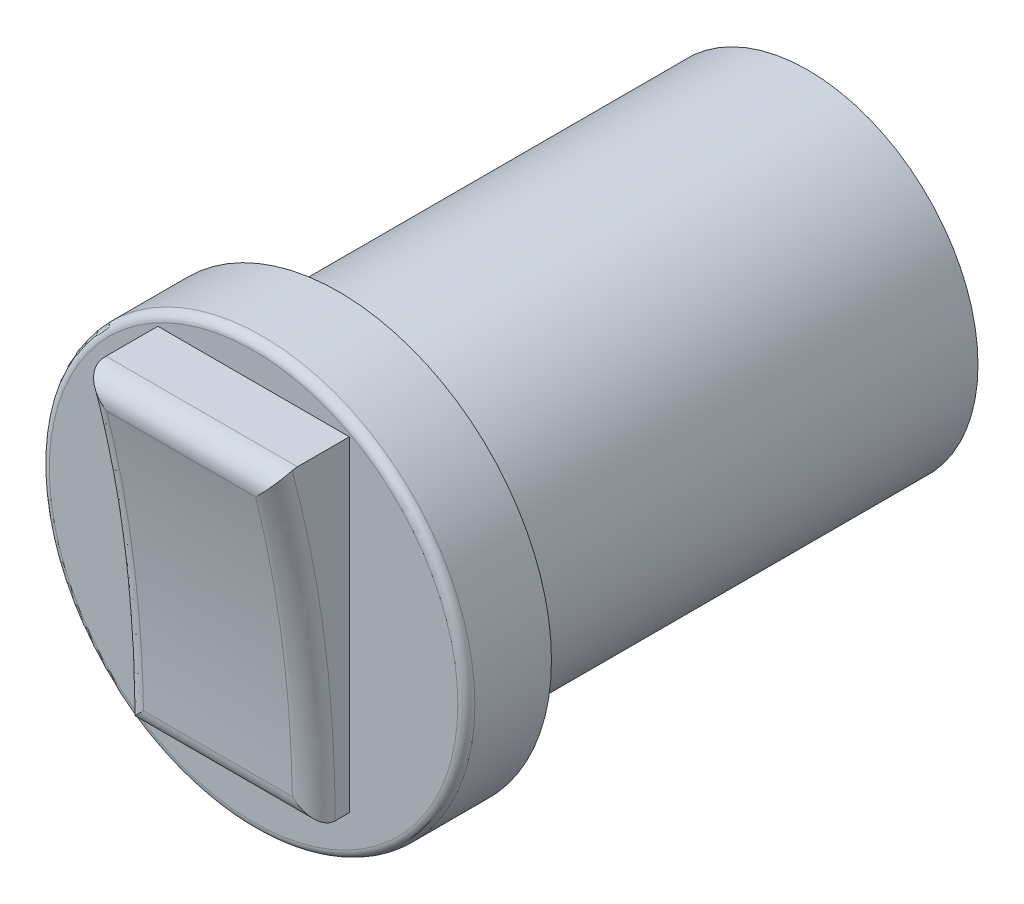
ISO-10303-21;
HEADER;
FILE_DESCRIPTION(('STEP AP214'),'2;1');
FILE_NAME('part.step','',(''),(''),'','','');
FILE_SCHEMA(('AUTOMOTIVE_DESIGN { 1 0 10303 214 1 1 1 1 }'));
ENDSEC;
DATA;
#1=APPLICATION_CONTEXT('core data for automotive mechanical design processes');
#2=APPLICATION_PROTOCOL_DEFINITION('international standard','automotive_design',2000,#1);
#3=PRODUCT_CONTEXT('',#1,'mechanical');
#4=PRODUCT('Part','Part','',(#3));
#5=PRODUCT_RELATED_PRODUCT_CATEGORY('part','',(#4));
#6=PRODUCT_DEFINITION_FORMATION('','',#4);
#7=PRODUCT_DEFINITION_CONTEXT('part definition',#1,'design');
#8=PRODUCT_DEFINITION('design','',#6,#7);
#9=PRODUCT_DEFINITION_SHAPE('','',#8);
#10=(LENGTH_UNIT() NAMED_UNIT(*) SI_UNIT(.MILLI.,.METRE.));
#11=(NAMED_UNIT(*) PLANE_ANGLE_UNIT() SI_UNIT($,.RADIAN.));
#12=(NAMED_UNIT(*) SI_UNIT($,.STERADIAN.) SOLID_ANGLE_UNIT());
#13=UNCERTAINTY_MEASURE_WITH_UNIT(LENGTH_MEASURE(1.E-05),#10,'distance_accuracy_value','');
#14=(GEOMETRIC_REPRESENTATION_CONTEXT(3) GLOBAL_UNCERTAINTY_ASSIGNED_CONTEXT((#13)) GLOBAL_UNIT_ASSIGNED_CONTEXT((#10,
#11,#12)) REPRESENTATION_CONTEXT('',''));
#15=CARTESIAN_POINT('',(0.,0.,0.));
#16=DIRECTION('',(0.,0.,1.));
#17=DIRECTION('',(1.,0.,0.));
#18=AXIS2_PLACEMENT_3D('',#15,#16,#17);
#19=CARTESIAN_POINT('',(0.,0.,33.08));
#20=DIRECTION('',(0.,0.,1.));
#21=DIRECTION('',(1.,0.,0.));
#22=AXIS2_PLACEMENT_3D('',#19,#20,#21);
#23=PLANE('',#22);
#24=CARTESIAN_POINT('',(0.,0.,33.08));
#25=DIRECTION('',(0.,0.,1.));
#26=DIRECTION('',(1.,0.,0.));
#27=AXIS2_PLACEMENT_3D('',#24,#25,#26);
#28=CIRCLE('',#27,12.192);
#29=CARTESIAN_POINT('',(12.192,0.,33.08));
#30=VERTEX_POINT('',#29);
#31=EDGE_CURVE('E41',#30,#30,#28,.T.);
#32=ORIENTED_EDGE('',*,*,#31,.T.);
#33=EDGE_LOOP('',(#32));
#34=FACE_BOUND('',#33,.T.);
#35=DIRECTION('',(-1.,0.,0.));
#36=VECTOR('',#35,1.);
#37=CARTESIAN_POINT('',(5.715,-8.83372150644757,33.08));
#38=LINE('',#37,#36);
#39=CARTESIAN_POINT('',(5.715,-8.83372150644757,33.08));
#40=VERTEX_POINT('',#39);
#41=CARTESIAN_POINT('',(-5.715,-8.83372150644757,33.08));
#42=VERTEX_POINT('',#41);
#43=EDGE_CURVE('E107',#40,#42,#38,.T.);
#44=ORIENTED_EDGE('',*,*,#43,.T.);
#45=DIRECTION('',(0.,1.,0.));
#46=VECTOR('',#45,1.);
#47=CARTESIAN_POINT('',(-5.715,-8.83372150644757,33.08));
#48=LINE('',#47,#46);
#49=CARTESIAN_POINT('',(-5.715,10.5940645602686,33.08));
#50=VERTEX_POINT('',#49);
#51=EDGE_CURVE('E250',#42,#50,#48,.T.);
#52=ORIENTED_EDGE('',*,*,#51,.T.);
#53=DIRECTION('',(-1.,0.,0.));
#54=VECTOR('',#53,1.);
#55=CARTESIAN_POINT('',(5.715,10.5940645602686,33.08));
#56=LINE('',#55,#54);
#57=CARTESIAN_POINT('',(5.715,10.5940645602686,33.08));
#58=VERTEX_POINT('',#57);
#59=EDGE_CURVE('E115',#58,#50,#56,.T.);
#60=ORIENTED_EDGE('',*,*,#59,.F.);
#61=DIRECTION('',(0.,1.,0.));
#62=VECTOR('',#61,1.);
#63=CARTESIAN_POINT('',(5.715,-8.83372150644757,33.08));
#64=LINE('',#63,#62);
#65=EDGE_CURVE('E100',#40,#58,#64,.T.);
#66=ORIENTED_EDGE('',*,*,#65,.F.);
#67=EDGE_LOOP('',(#44,#52,#60,#66));
#68=FACE_BOUND('',#67,.T.);
#69=ADVANCED_FACE('F33',(#34,#68),#23,.T.);
#70=CARTESIAN_POINT('',(0.,0.,28.));
#71=DIRECTION('',(0.,0.,-1.));
#72=DIRECTION('',(-1.,0.,0.));
#73=AXIS2_PLACEMENT_3D('',#70,#71,#72);
#74=CYLINDRICAL_SURFACE('',#73,10.16);
#75=CARTESIAN_POINT('',(0.,0.,28.));
#76=DIRECTION('',(0.,0.,1.));
#77=DIRECTION('',(1.,0.,0.));
#78=AXIS2_PLACEMENT_3D('',#75,#76,#77);
#79=CIRCLE('',#78,10.16);
#80=CARTESIAN_POINT('',(10.16,0.,28.));
#81=VERTEX_POINT('',#80);
#82=EDGE_CURVE('E172',#81,#81,#79,.T.);
#83=ORIENTED_EDGE('',*,*,#82,.F.);
#84=EDGE_LOOP('',(#83));
#85=FACE_BOUND('',#84,.T.);
#86=CARTESIAN_POINT('',(0.,0.,0.));
#87=DIRECTION('',(0.,0.,1.));
#88=DIRECTION('',(1.,0.,0.));
#89=AXIS2_PLACEMENT_3D('',#86,#87,#88);
#90=CIRCLE('',#89,10.16);
#91=CARTESIAN_POINT('',(10.16,0.,0.));
#92=VERTEX_POINT('',#91);
#93=EDGE_CURVE('E173',#92,#92,#90,.T.);
#94=ORIENTED_EDGE('',*,*,#93,.T.);
#95=EDGE_LOOP('',(#94));
#96=FACE_BOUND('',#95,.T.);
#97=ADVANCED_FACE('F178',(#85,#96),#74,.T.);
#98=CARTESIAN_POINT('',(0.,0.,0.));
#99=DIRECTION('',(0.,0.,1.));
#100=DIRECTION('',(1.,0.,0.));
#101=AXIS2_PLACEMENT_3D('',#98,#99,#100);
#102=PLANE('',#101);
#103=ORIENTED_EDGE('',*,*,#93,.F.);
#104=EDGE_LOOP('',(#103));
#105=FACE_BOUND('',#104,.T.);
#106=ADVANCED_FACE('F223',(#105),#102,.F.);
#107=CARTESIAN_POINT('',(0.,0.,33.08));
#108=DIRECTION('',(0.,0.,-1.));
#109=DIRECTION('',(-1.,0.,0.));
#110=AXIS2_PLACEMENT_3D('',#107,#108,#109);
#111=CYLINDRICAL_SURFACE('',#110,12.7);
#112=CARTESIAN_POINT('',(0.,0.,32.572));
#113=DIRECTION('',(0.,0.,1.));
#114=DIRECTION('',(1.,0.,0.));
#115=AXIS2_PLACEMENT_3D('',#112,#113,#114);
#116=CIRCLE('',#115,12.7);
#117=CARTESIAN_POINT('',(12.7,0.,32.572));
#118=VERTEX_POINT('',#117);
#119=EDGE_CURVE('E11',#118,#118,#116,.F.);
#120=ORIENTED_EDGE('',*,*,#119,.T.);
#121=EDGE_LOOP('',(#120));
#122=FACE_BOUND('',#121,.T.);
#123=CARTESIAN_POINT('',(0.,0.,28.));
#124=DIRECTION('',(0.,0.,1.));
#125=DIRECTION('',(1.,0.,0.));
#126=AXIS2_PLACEMENT_3D('',#123,#124,#125);
#127=CIRCLE('',#126,12.7);
#128=CARTESIAN_POINT('',(12.7,0.,28.));
#129=VERTEX_POINT('',#128);
#130=EDGE_CURVE('E114',#129,#129,#127,.T.);
#131=ORIENTED_EDGE('',*,*,#130,.T.);
#132=EDGE_LOOP('',(#131));
#133=FACE_BOUND('',#132,.T.);
#134=ADVANCED_FACE('F231',(#122,#133),#111,.T.);
#135=CARTESIAN_POINT('',(0.,0.,28.));
#136=DIRECTION('',(0.,0.,1.));
#137=DIRECTION('',(1.,0.,0.));
#138=AXIS2_PLACEMENT_3D('',#135,#136,#137);
#139=PLANE('',#138);
#140=ORIENTED_EDGE('',*,*,#82,.T.);
#141=EDGE_LOOP('',(#140));
#142=FACE_BOUND('',#141,.T.);
#143=ORIENTED_EDGE('',*,*,#130,.F.);
#144=EDGE_LOOP('',(#143));
#145=FACE_BOUND('',#144,.T.);
#146=ADVANCED_FACE('F228',(#142,#145),#139,.F.);
#147=CARTESIAN_POINT('',(5.715,-8.83372150644757,35.1996363705034));
#148=DIRECTION('',(0.,1.,0.));
#149=DIRECTION('',(0.,0.,1.));
#150=AXIS2_PLACEMENT_3D('',#147,#148,#149);
#151=PLANE('',#150);
#152=DIRECTION('',(0.,0.,-1.));
#153=VECTOR('',#152,1.);
#154=CARTESIAN_POINT('',(5.715,-8.83372150644757,35.1996363705034));
#155=LINE('',#154,#153);
#156=CARTESIAN_POINT('',(5.715,-8.83372150644757,33.9296363644892));
#157=VERTEX_POINT('',#156);
#158=EDGE_CURVE('E95',#157,#40,#155,.T.);
#159=ORIENTED_EDGE('',*,*,#158,.F.);
#160=CARTESIAN_POINT('',(5.715,-13.965042147608,33.9301399690433));
#161=CARTESIAN_POINT('',(5.715,-13.9649175056386,35.2001399629269));
#162=CARTESIAN_POINT('',(4.445,-13.9649175056386,35.2001399629269));
#163=CARTESIAN_POINT('',(5.715,-12.254643525228,33.9299721049536));
#164=CARTESIAN_POINT('',(5.715,-12.2545188832586,35.1999720988372));
#165=CARTESIAN_POINT('',(4.445,-12.2545188832586,35.19997209879));
#166=CARTESIAN_POINT('',(5.715,-10.544244902848,33.929804240864));
#167=CARTESIAN_POINT('',(5.715,-10.5441202608786,35.1998042347476));
#168=CARTESIAN_POINT('',(4.445,-10.5441202608786,35.1998042346532));
#169=CARTESIAN_POINT('',(5.715,-8.83384628046798,33.9296363767744));
#170=CARTESIAN_POINT('',(5.715,-8.83372163849857,35.199636370658));
#171=CARTESIAN_POINT('',(4.445,-8.83372163849858,35.1996363705163));
#172=CARTESIAN_POINT('',(5.715,-8.42963563821013,33.9295976491301));
#173=CARTESIAN_POINT('',(5.715,-8.43626265218967,35.1995982833622));
#174=CARTESIAN_POINT('',(4.445,-8.43626265218958,35.1995982833089));
#175=CARTESIAN_POINT('',(5.715,-8.0254413482804,33.9327811983764));
#176=CARTESIAN_POINT('',(5.715,-8.03884338245092,35.2027286445675));
#177=CARTESIAN_POINT('',(4.445,-8.03884338245087,35.2027286445527));
#178=CARTESIAN_POINT('',(5.715,-7.21706929587753,33.9456374825781));
#179=CARTESIAN_POINT('',(5.715,-7.24406357570781,35.2153687833632));
#180=CARTESIAN_POINT('',(4.445,-7.24406357570785,35.215368783378));
#181=CARTESIAN_POINT('',(5.715,-6.81289155558649,33.9553116106791));
#182=CARTESIAN_POINT('',(5.715,-6.84670306963512,35.2248799305331));
#183=CARTESIAN_POINT('',(4.445,-6.84670306963521,35.2248799305392));
#184=CARTESIAN_POINT('',(5.715,-5.14527972829637,34.0087171179528));
#185=CARTESIAN_POINT('',(5.715,-5.20729653609095,35.277381981281));
#186=CARTESIAN_POINT('',(4.445,-5.20729653609067,35.277381981262));
#187=CARTESIAN_POINT('',(5.715,-3.88260918612009,34.0811225077073));
#188=CARTESIAN_POINT('',(5.715,-3.96616667572511,35.3485558907923));
#189=CARTESIAN_POINT('',(4.445,-3.96616667572323,35.3485558907806));
#190=CARTESIAN_POINT('',(5.715,-1.36271675769742,34.2904767846415));
#191=CARTESIAN_POINT('',(5.715,-1.48947315865634,35.5543213530028));
#192=CARTESIAN_POINT('',(4.445,-1.48947315865822,35.5543213530145));
#193=CARTESIAN_POINT('',(5.715,-0.105495100454355,34.4274283584962));
#194=CARTESIAN_POINT('',(5.715,-0.253909735812633,35.6889155455123));
#195=CARTESIAN_POINT('',(4.445,-0.253909735819868,35.6889155455399));
#196=CARTESIAN_POINT('',(5.715,2.81401100549183,34.8218592193152));
#197=CARTESIAN_POINT('',(5.715,2.6152536749403,36.0765442086322));
#198=CARTESIAN_POINT('',(4.445,2.61525367494993,36.0765442085954));
#199=CARTESIAN_POINT('',(5.715,4.47304419799336,35.1041993729821));
#200=CARTESIAN_POINT('',(5.715,4.2456425140227,36.3540073980327));
#201=CARTESIAN_POINT('',(4.445,4.24564251406421,36.3540073978818));
#202=CARTESIAN_POINT('',(5.715,6.92825075345207,35.6087990884644));
#203=CARTESIAN_POINT('',(5.715,6.65869438975662,36.8499441001382));
#204=CARTESIAN_POINT('',(4.445,6.65869438973625,36.8499441002123));
#205=CARTESIAN_POINT('',(5.715,7.73345584996541,35.7883971730167));
#206=CARTESIAN_POINT('',(5.715,7.4501129201041,37.026465982265));
#207=CARTESIAN_POINT('',(4.445,7.4501129200457,37.0264659824769));
#208=CARTESIAN_POINT('',(5.715,9.33753257975253,36.1742440101229));
#209=CARTESIAN_POINT('',(5.715,9.02684358289949,37.4057350948788));
#210=CARTESIAN_POINT('',(4.445,9.02684358295789,37.405735094667));
#211=CARTESIAN_POINT('',(5.715,10.1364036410945,36.3804951408717));
#212=CARTESIAN_POINT('',(5.715,9.81215516380003,37.6084846656086));
#213=CARTESIAN_POINT('',(4.445,9.81215516401329,37.6084846648352));
#214=CARTESIAN_POINT('',(5.715,10.9317316935142,36.5998599164276));
#215=CARTESIAN_POINT('',(5.715,10.5940644915419,37.8241478158664));
#216=CARTESIAN_POINT('',(4.445,10.5940644921206,37.8241478137682));
#217=CARTESIAN_POINT('',(5.715,10.9623874990024,36.6083150004745));
#218=CARTESIAN_POINT('',(5.715,10.624720317845,37.8326029056542));
#219=CARTESIAN_POINT('',(4.445,10.6247203182299,37.8326029042587));
#220=CARTESIAN_POINT('',(5.715,10.9930433044897,36.6167700845248));
#221=CARTESIAN_POINT('',(5.715,10.6553761440497,37.8410579954184));
#222=CARTESIAN_POINT('',(4.445,10.6553761442417,37.8410579947223));
#223=CARTESIAN_POINT('',(5.715,17.5033395244865,38.4123549951186));
#224=CARTESIAN_POINT('',(5.715,17.1656767430348,39.6366441137672));
#225=CARTESIAN_POINT('',(4.445,17.1656767024541,39.6366442609017));
#226=CARTESIAN_POINT('',(5.715,23.9829798984164,40.1994849687921));
#227=CARTESIAN_POINT('',(5.715,23.6453171169647,41.4237740874406));
#228=CARTESIAN_POINT('',(4.445,23.645317076384,41.4237742345752));
#229=CARTESIAN_POINT('',(5.715,30.4626202317657,41.9866150895988));
#230=CARTESIAN_POINT('',(5.715,30.1249530919456,43.2109030061795));
#231=CARTESIAN_POINT('',(4.445,30.1249530919456,43.2109030061795));
#232=(BOUNDED_SURFACE() B_SPLINE_SURFACE(3,2,((#160,#161,#162),(#163,#164,#165),(#166,#167,
#168),(#169,#170,#171),(#172,#173,#174),(#175,#176,#177),(#178,#179,#180),(#181,#182,#183),
(#184,#185,#186),(#187,#188,#189),(#190,#191,#192),(#193,#194,#195),(#196,#197,#198),(#199,#200,
#201),(#202,#203,#204),(#205,#206,#207),(#208,#209,#210),(#211,#212,#213),(#214,#215,#216),
(#217,#218,#219),(#220,#221,#222),(#223,#224,#225),(#226,#227,#228),(#229,#230,#231)),
.UNSPECIFIED.,.F.,.F.,.F.) B_SPLINE_SURFACE_WITH_KNOTS((4,3,2,2,2,2,2,2,3,2,4),(3,3),(0.,
5.13119589185211,6.34378124637305,7.55662695498056,11.3489833310845,15.1414975744391,
20.1856356214669,22.6602332857293,25.1350519057622,25.2304531725637,45.3951787165521),(0.,1.),
.UNSPECIFIED.) GEOMETRIC_REPRESENTATION_ITEM() RATIONAL_B_SPLINE_SURFACE(((1.,0.707106781186548,
1.),(1.,0.707106781186548,1.),(1.,0.707106781186548,1.),(1.,0.707106781186548,1.),(1.,
0.707106781186548,1.),(1.,0.707106781186548,1.),(1.,0.707106781186548,1.),(1.,0.707106781186548,
1.),(1.,0.707106781186548,1.),(1.,0.707106781186548,1.),(1.,0.707106781186548,1.),(1.,
0.707106781186548,1.),(1.,0.707106781186548,1.),(1.,0.707106781186548,1.),(1.,0.707106781186548,
1.),(1.,0.707106781186548,1.),(1.,0.707106781186548,1.),(1.,0.707106781186548,1.),(1.,
0.707106781186548,1.),(1.,0.707106781186548,1.),(1.,0.707106781186548,1.),(1.,0.707106781186548,
1.),(1.,0.707106781186548,1.),(1.,0.707106781186548,1.))) REPRESENTATION_ITEM('') SURFACE());
#233=CARTESIAN_POINT('',(5.715,-8.83372150644757,33.9296363644892));
#234=CARTESIAN_POINT('',(5.71499999997017,-8.83372150644757,33.9313880672006));
#235=CARTESIAN_POINT('',(5.71499637584916,-8.83372150644757,33.9331397549159));
#236=CARTESIAN_POINT('',(5.7149818794248,-8.83372150644757,33.9366431003545));
#237=CARTESIAN_POINT('',(5.71497100712144,-8.83372150644757,33.9383947580778));
#238=CARTESIAN_POINT('',(5.71495651072691,-8.83372150644757,33.940146400805));
#239=B_SPLINE_CURVE_WITH_KNOTS('',3,(#233,#234,#235,#236,#237,#238),.UNSPECIFIED.,.F.,.F.,(4,2,
4),(0.,0.00525507439316059,0.0105101487863239),.UNSPECIFIED.);
#240=CARTESIAN_POINT('',(5.71495651072691,-8.83372150644757,33.940146400805));
#241=VERTEX_POINT('',#240);
#242=EDGE_CURVE('E48',#157,#241,#239,.T.);
#243=ORIENTED_EDGE('',*,*,#242,.T.);
#244=DIRECTION('',(-1.,0.,0.));
#245=VECTOR('',#244,1.);
#246=CARTESIAN_POINT('',(5.715,-8.83372150644757,33.940146400805));
#247=LINE('',#246,#245);
#248=CARTESIAN_POINT('',(-5.71495651072691,-8.83372150644757,33.940146400805));
#249=VERTEX_POINT('',#248);
#250=EDGE_CURVE('E52',#241,#249,#247,.T.);
#251=ORIENTED_EDGE('',*,*,#250,.T.);
#252=CARTESIAN_POINT('',(-5.715,15.8941794874759,37.9685376005211));
#253=CARTESIAN_POINT('',(-5.715,15.5565123476558,39.1928255171019));
#254=CARTESIAN_POINT('',(-4.445,15.5565123476558,39.1928255171019));
#255=CARTESIAN_POINT('',(-5.715,14.2400302256952,37.5123117059335));
#256=CARTESIAN_POINT('',(-5.715,13.902363085875,38.7365996225143));
#257=CARTESIAN_POINT('',(-4.445,13.9023630858931,38.7365996224489));
#258=CARTESIAN_POINT('',(-5.715,12.5858809639144,37.056085811346));
#259=CARTESIAN_POINT('',(-5.715,12.2482138240943,38.2803737279267));
#260=CARTESIAN_POINT('',(-4.445,12.2482138241304,38.2803737277958));
#261=CARTESIAN_POINT('',(-5.715,10.9317317021336,36.5998599167584));
#262=CARTESIAN_POINT('',(-5.715,10.5940645623135,37.8241478333392));
#263=CARTESIAN_POINT('',(-4.445,10.5940645623676,37.8241478331428));
#264=CARTESIAN_POINT('',(-5.715,10.5447327793352,36.4931238975029));
#265=CARTESIAN_POINT('',(-5.715,10.21359532655,37.7192127231819));
#266=CARTESIAN_POINT('',(-4.445,10.2135953265702,37.7192127231085));
#267=CARTESIAN_POINT('',(-5.715,10.1568963456861,36.3894873465015));
#268=CARTESIAN_POINT('',(-5.715,9.83232162308447,37.6173299929286));
#269=CARTESIAN_POINT('',(-4.445,9.83232162309008,37.6173299929082));
#270=CARTESIAN_POINT('',(-5.715,9.37952477935658,36.1884446960625));
#271=CARTESIAN_POINT('',(-5.715,9.06813757400899,37.4196979050723));
#272=CARTESIAN_POINT('',(-4.445,9.06813757400337,37.4196979050926));
#273=CARTESIAN_POINT('',(-5.715,8.98998930551058,36.091039915893));
#274=CARTESIAN_POINT('',(-5.715,8.68522690003544,37.3239498461751));
#275=CARTESIAN_POINT('',(-4.445,8.68522690003324,37.3239498461831));
#276=CARTESIAN_POINT('',(-5.715,7.37079840374572,35.7000460287323));
#277=CARTESIAN_POINT('',(-5.715,7.09363309402307,36.9396197724997));
#278=CARTESIAN_POINT('',(-4.445,7.09363309403001,36.9396197724744));
#279=CARTESIAN_POINT('',(-5.715,6.13419559375174,35.4345629106751));
#280=CARTESIAN_POINT('',(-5.715,5.8782488664165,36.6786948039194));
#281=CARTESIAN_POINT('',(-4.445,5.87824886641837,36.6786948039116));
#282=CARTESIAN_POINT('',(-5.715,3.64906117219458,34.967522856939));
#283=CARTESIAN_POINT('',(-5.715,3.43588337999361,36.2196926652568));
#284=CARTESIAN_POINT('',(-4.445,3.43588337999173,36.2196926652646));
#285=CARTESIAN_POINT('',(-5.715,2.40052899696202,34.7659689574941));
#286=CARTESIAN_POINT('',(-5.715,2.20890157321468,36.0216184801894));
#287=CARTESIAN_POINT('',(-4.445,2.20890157321412,36.0216184801953));
#288=CARTESIAN_POINT('',(-5.715,-0.519014080273826,34.371598461028));
#289=CARTESIAN_POINT('',(-5.715,-0.660298177477254,35.6340475742815));
#290=CARTESIAN_POINT('',(-4.445,-0.66029817747651,35.6340475742737));
#291=CARTESIAN_POINT('',(-5.715,-2.19348359372,34.2036123509144));
#292=CARTESIAN_POINT('',(-5.715,-2.30593141280172,35.4689496882407));
#293=CARTESIAN_POINT('',(-4.445,-2.30593141280157,35.4689496882179));
#294=CARTESIAN_POINT('',(-5.715,-4.69727075988399,34.0380409692224));
#295=CARTESIAN_POINT('',(-5.715,-4.7669506552399,35.3062071853564));
#296=CARTESIAN_POINT('',(-4.445,-4.76695065523997,35.3062071853676));
#297=CARTESIAN_POINT('',(-5.715,-5.52399074230332,33.9972431878966));
#298=CARTESIAN_POINT('',(-5.715,-5.57960592564652,35.2661020743496));
#299=CARTESIAN_POINT('',(-4.445,-5.57960592564656,35.2661020743812));
#300=CARTESIAN_POINT('',(-5.715,-7.17839988846795,33.9429956169611));
#301=CARTESIAN_POINT('',(-5.715,-7.20602565351021,35.2127723767824));
#302=CARTESIAN_POINT('',(-4.445,-7.20602565351017,35.2127723767508));
#303=CARTESIAN_POINT('',(-5.715,-8.00608912898166,33.9295481641498));
#304=CARTESIAN_POINT('',(-5.715,-8.01979019979986,35.1995500870768));
#305=CARTESIAN_POINT('',(-4.445,-8.0197901997998,35.1995500869616));
#306=CARTESIAN_POINT('',(-5.715,-8.83384627020827,33.9296363769435));
#307=CARTESIAN_POINT('',(-5.715,-8.83372132018636,35.1996363707968));
#308=CARTESIAN_POINT('',(-4.445,-8.83372132018639,35.1996363704851));
#309=CARTESIAN_POINT('',(-5.715,-8.86016143074627,33.9296389594954));
#310=CARTESIAN_POINT('',(-5.715,-8.86003658380897,35.1996389533589));
#311=CARTESIAN_POINT('',(-4.445,-8.86003658380899,35.1996389531515));
#312=CARTESIAN_POINT('',(-5.715,-8.88647659128427,33.9296415420478));
#313=CARTESIAN_POINT('',(-5.715,-8.88635184703113,35.1996415359213));
#314=CARTESIAN_POINT('',(-4.445,-8.88635184703114,35.1996415358178));
#315=CARTESIAN_POINT('',(-5.715,-15.6343669007829,33.9303037756155));
#316=CARTESIAN_POINT('',(-5.715,-15.634268384732,35.2003037720667));
#317=CARTESIAN_POINT('',(-4.445,-15.6342683847293,35.2003037985046));
#318=CARTESIAN_POINT('',(-5.715,-22.355942049741,33.9309634530708));
#319=CARTESIAN_POINT('',(-5.715,-22.35584353369,35.2009634495219));
#320=CARTESIAN_POINT('',(-4.445,-22.3558435336874,35.2009634759598));
#321=CARTESIAN_POINT('',(-5.715,-29.0775171986963,33.9316231569662));
#322=CARTESIAN_POINT('',(-5.715,-29.0773925567269,35.2016231508498));
#323=CARTESIAN_POINT('',(-4.445,-29.0773925567269,35.2016231508498));
#324=(BOUNDED_SURFACE() B_SPLINE_SURFACE(3,2,((#252,#253,#254),(#255,#256,#257),(#258,#259,
#260),(#261,#262,#263),(#264,#265,#266),(#267,#268,#269),(#270,#271,#272),(#273,#274,#275),
(#276,#277,#278),(#279,#280,#281),(#282,#283,#284),(#285,#286,#287),(#288,#289,#290),(#291,#292,
#293),(#294,#295,#296),(#297,#298,#299),(#300,#301,#302),(#303,#304,#305),(#306,#307,#308),
(#309,#310,#311),(#312,#313,#314),(#315,#316,#317),(#318,#319,#320),(#321,#322,#323)),
.UNSPECIFIED.,.F.,.F.,.F.) B_SPLINE_SURFACE_WITH_KNOTS((4,3,2,2,2,2,2,2,3,2,4),(3,3),(0.,
5.14773412525153,6.35203244765364,7.55658488251796,11.349023208135,15.1416416236475,
20.1857694705138,22.6685736975322,25.1515900451884,25.2305355271826,45.395261071171),(0.,1.),
.UNSPECIFIED.) GEOMETRIC_REPRESENTATION_ITEM() RATIONAL_B_SPLINE_SURFACE(((1.,0.707106781186548,
1.),(1.,0.707106781186548,1.),(1.,0.707106781186548,1.),(1.,0.707106781186548,1.),(1.,
0.707106781186548,1.),(1.,0.707106781186548,1.),(1.,0.707106781186548,1.),(1.,0.707106781186548,
1.),(1.,0.707106781186548,1.),(1.,0.707106781186548,1.),(1.,0.707106781186548,1.),(1.,
0.707106781186548,1.),(1.,0.707106781186548,1.),(1.,0.707106781186548,1.),(1.,0.707106781186548,
1.),(1.,0.707106781186548,1.),(1.,0.707106781186548,1.),(1.,0.707106781186548,1.),(1.,
0.707106781186548,1.),(1.,0.707106781186548,1.),(1.,0.707106781186548,1.),(1.,0.707106781186548,
1.),(1.,0.707106781186548,1.),(1.,0.707106781186548,1.))) REPRESENTATION_ITEM('') SURFACE());
#325=CARTESIAN_POINT('',(-5.71495651072691,-8.83372150644757,33.940146400805));
#326=CARTESIAN_POINT('',(-5.71497100711822,-8.83372150644757,33.9383947580778));
#327=CARTESIAN_POINT('',(-5.71498187941997,-8.83372150644757,33.9366431003545));
#328=CARTESIAN_POINT('',(-5.71499637584433,-8.83372150644757,33.9331397549159));
#329=CARTESIAN_POINT('',(-5.71499999996695,-8.83372150644757,33.9313880672006));
#330=CARTESIAN_POINT('',(-5.715,-8.83372150644757,33.9296363644892));
#331=B_SPLINE_CURVE_WITH_KNOTS('',3,(#325,#326,#327,#328,#329,#330),.UNSPECIFIED.,.F.,.F.,(4,2,
4),(0.,0.00525507439314719,0.0105101487863039),.UNSPECIFIED.);
#332=CARTESIAN_POINT('',(-5.715,-8.83372150644757,33.9296363644892));
#333=VERTEX_POINT('',#332);
#334=EDGE_CURVE('E279',#249,#333,#331,.T.);
#335=ORIENTED_EDGE('',*,*,#334,.T.);
#336=DIRECTION('',(0.,0.,-1.));
#337=VECTOR('',#336,1.);
#338=CARTESIAN_POINT('',(-5.715,-8.83372150644757,35.1996363705034));
#339=LINE('',#338,#337);
#340=EDGE_CURVE('E110',#333,#42,#339,.T.);
#341=ORIENTED_EDGE('',*,*,#340,.T.);
#342=ORIENTED_EDGE('',*,*,#43,.F.);
#343=EDGE_LOOP('',(#159,#243,#251,#335,#341,#342));
#344=FACE_BOUND('',#343,.T.);
#345=ADVANCED_FACE('F108',(#344),#151,.F.);
#346=CARTESIAN_POINT('',(5.715,10.5940645602686,33.08));
#347=DIRECTION('',(0.,-1.,0.));
#348=DIRECTION('',(0.,0.,-1.));
#349=AXIS2_PLACEMENT_3D('',#346,#347,#348);
#350=PLANE('',#349);
#351=DIRECTION('',(0.,0.,1.));
#352=VECTOR('',#351,1.);
#353=CARTESIAN_POINT('',(-5.715,10.5940645602686,33.08));
#354=LINE('',#353,#352);
#355=CARTESIAN_POINT('',(-5.715,10.5940645602686,36.1755531886548));
#356=VERTEX_POINT('',#355);
#357=EDGE_CURVE('E104',#50,#356,#354,.T.);
#358=ORIENTED_EDGE('',*,*,#357,.T.);
#359=DIRECTION('',(-1.,0.,0.));
#360=VECTOR('',#359,1.);
#361=CARTESIAN_POINT('',(5.715,10.5940645602686,36.1755531886548));
#362=LINE('',#361,#360);
#363=CARTESIAN_POINT('',(5.715,10.5940645602686,36.1755531886548));
#364=VERTEX_POINT('',#363);
#365=EDGE_CURVE('E199',#356,#364,#362,.F.);
#366=ORIENTED_EDGE('',*,*,#365,.T.);
#367=DIRECTION('',(0.,0.,1.));
#368=VECTOR('',#367,1.);
#369=CARTESIAN_POINT('',(5.715,10.5940645602686,33.08));
#370=LINE('',#369,#368);
#371=EDGE_CURVE('E118',#58,#364,#370,.T.);
#372=ORIENTED_EDGE('',*,*,#371,.F.);
#373=ORIENTED_EDGE('',*,*,#59,.T.);
#374=EDGE_LOOP('',(#358,#366,#372,#373));
#375=FACE_BOUND('',#374,.T.);
#376=ADVANCED_FACE('F136',(#375),#350,.F.);
#377=CARTESIAN_POINT('',(5.715,10.5940645602686,37.8241478325639));
#378=CARTESIAN_POINT('',(5.715,1.07478402137783,35.1986639172366));
#379=CARTESIAN_POINT('',(5.715,-8.83372150644757,35.1996363705034));
#380=B_SPLINE_CURVE_WITH_KNOTS('',2,(#377,#378,#379),.UNSPECIFIED.,.F.,.F.,(3,3),(0.,1.),.UNSPECIFIED.);
#381=DIRECTION('',(-1.,0.,0.));
#382=VECTOR('',#381,1.);
#383=SURFACE_OF_LINEAR_EXTRUSION('',#380,#382);
#384=CARTESIAN_POINT('',(4.445,-13.9649175056386,35.2001399629269));
#385=CARTESIAN_POINT('',(4.445,-12.2545188832586,35.19997209879));
#386=CARTESIAN_POINT('',(4.445,-10.5441202608786,35.1998042346532));
#387=CARTESIAN_POINT('',(4.445,-8.83372163849858,35.1996363705163));
#388=CARTESIAN_POINT('',(4.445,-8.43626265218959,35.1995982833089));
#389=CARTESIAN_POINT('',(4.445,-8.03884338245087,35.2027286445527));
#390=CARTESIAN_POINT('',(4.445,-7.24406357570785,35.215368783378));
#391=CARTESIAN_POINT('',(4.445,-6.84670306963521,35.2248799305392));
#392=CARTESIAN_POINT('',(4.445,-5.20729653609067,35.277381981262));
#393=CARTESIAN_POINT('',(4.445,-3.96616667572323,35.3485558907806));
#394=CARTESIAN_POINT('',(4.445,-1.48947315865822,35.5543213530145));
#395=CARTESIAN_POINT('',(4.445,-0.253909735819867,35.6889155455399));
#396=CARTESIAN_POINT('',(4.445,2.61525367494993,36.0765442085954));
#397=CARTESIAN_POINT('',(4.445,4.24564251406421,36.3540073978818));
#398=CARTESIAN_POINT('',(4.445,6.65869438973625,36.8499441002123));
#399=CARTESIAN_POINT('',(4.445,7.4501129200457,37.0264659824769));
#400=CARTESIAN_POINT('',(4.445,9.02684358295789,37.405735094667));
#401=CARTESIAN_POINT('',(4.445,9.81215516401329,37.6084846648352));
#402=CARTESIAN_POINT('',(4.445,10.5940644921206,37.8241478137682));
#403=CARTESIAN_POINT('',(4.445,10.6247203182299,37.8326029042587));
#404=CARTESIAN_POINT('',(4.445,10.6553761442417,37.8410579947223));
#405=CARTESIAN_POINT('',(4.445,17.1656767024542,39.6366442609016));
#406=CARTESIAN_POINT('',(4.445,23.6453170763841,41.423774234575));
#407=CARTESIAN_POINT('',(4.445,30.1249530919456,43.2109030061795));
#408=B_SPLINE_CURVE_WITH_KNOTS('',3,(#384,#385,#386,#387,#388,#389,#390,#391,#392,#393,#394,
#395,#396,#397,#398,#399,#400,#401,#402,#403,#404,#405,#406,#407),.UNSPECIFIED.,.F.,.F.,(4,3,2,
2,2,2,2,2,3,2,4),(0.,5.13119589185211,6.34378124637305,7.55662695498056,11.3489833310845,
15.1414975744391,20.1856356214669,22.6602332857293,25.1350519057622,25.2304531725637,
45.3951787165521),.UNSPECIFIED.);
#409=CARTESIAN_POINT('',(4.445,-7.58488719686994,35.2099700159378));
#410=VERTEX_POINT('',#409);
#411=CARTESIAN_POINT('',(4.445,9.01362531329987,37.4070268887156));
#412=VERTEX_POINT('',#411);
#413=EDGE_CURVE('E184',#410,#412,#408,.T.);
#414=ORIENTED_EDGE('',*,*,#413,.T.);
#415=DIRECTION('',(-1.,0.,0.));
#416=VECTOR('',#415,1.);
#417=CARTESIAN_POINT('',(4.445,9.01362531329987,37.4070268887156));
#418=LINE('',#417,#416);
#419=CARTESIAN_POINT('',(-4.445,9.01362531329987,37.4070268887156));
#420=VERTEX_POINT('',#419);
#421=EDGE_CURVE('E189',#412,#420,#418,.T.);
#422=ORIENTED_EDGE('',*,*,#421,.T.);
#423=CARTESIAN_POINT('',(-4.445,15.5565123476558,39.1928255171019));
#424=CARTESIAN_POINT('',(-4.445,13.9023630858931,38.7365996224489));
#425=CARTESIAN_POINT('',(-4.445,12.2482138241304,38.2803737277958));
#426=CARTESIAN_POINT('',(-4.445,10.5940645623676,37.8241478331428));
#427=CARTESIAN_POINT('',(-4.445,10.2135953265702,37.7192127231085));
#428=CARTESIAN_POINT('',(-4.445,9.83232162309008,37.6173299929082));
#429=CARTESIAN_POINT('',(-4.445,9.06813757400337,37.4196979050926));
#430=CARTESIAN_POINT('',(-4.445,8.68522690003323,37.3239498461831));
#431=CARTESIAN_POINT('',(-4.445,7.09363309403001,36.9396197724744));
#432=CARTESIAN_POINT('',(-4.445,5.87824886641837,36.6786948039116));
#433=CARTESIAN_POINT('',(-4.445,3.43588337999173,36.2196926652646));
#434=CARTESIAN_POINT('',(-4.445,2.20890157321412,36.0216184801953));
#435=CARTESIAN_POINT('',(-4.445,-0.66029817747651,35.6340475742737));
#436=CARTESIAN_POINT('',(-4.445,-2.30593141280157,35.4689496882179));
#437=CARTESIAN_POINT('',(-4.445,-4.76695065523997,35.3062071853676));
#438=CARTESIAN_POINT('',(-4.445,-5.57960592564656,35.2661020743812));
#439=CARTESIAN_POINT('',(-4.445,-7.20602565351017,35.2127723767508));
#440=CARTESIAN_POINT('',(-4.445,-8.0197901997998,35.1995500869616));
#441=CARTESIAN_POINT('',(-4.445,-8.83372132018639,35.1996363704851));
#442=CARTESIAN_POINT('',(-4.445,-8.86003658380899,35.1996389531515));
#443=CARTESIAN_POINT('',(-4.445,-8.88635184703114,35.1996415358178));
#444=CARTESIAN_POINT('',(-4.445,-15.6342683847294,35.2003037985045));
#445=CARTESIAN_POINT('',(-4.445,-22.3558435336874,35.2009634759598));
#446=CARTESIAN_POINT('',(-4.445,-29.0773925567269,35.2016231508498));
#447=B_SPLINE_CURVE_WITH_KNOTS('',3,(#423,#424,#425,#426,#427,#428,#429,#430,#431,#432,#433,
#434,#435,#436,#437,#438,#439,#440,#441,#442,#443,#444,#445,#446),.UNSPECIFIED.,.F.,.F.,(4,3,2,
2,2,2,2,2,3,2,4),(0.,5.14773412525153,6.35203244765364,7.55658488251796,11.349023208135,
15.1416416236475,20.1857694705138,22.6685736975322,25.1515900451884,25.2305355271826,
45.395261071171),.UNSPECIFIED.);
#448=CARTESIAN_POINT('',(-4.445,-7.58488719686994,35.2099700159378));
#449=VERTEX_POINT('',#448);
#450=EDGE_CURVE('E164',#420,#449,#447,.T.);
#451=ORIENTED_EDGE('',*,*,#450,.T.);
#452=DIRECTION('',(-1.,0.,0.));
#453=VECTOR('',#452,1.);
#454=CARTESIAN_POINT('',(-4.445,-7.58488719686994,35.2099700159378));
#455=LINE('',#454,#453);
#456=EDGE_CURVE('E171',#449,#410,#455,.F.);
#457=ORIENTED_EDGE('',*,*,#456,.T.);
#458=EDGE_LOOP('',(#414,#422,#451,#457));
#459=FACE_BOUND('',#458,.T.);
#460=ADVANCED_FACE('F131',(#459),#383,.F.);
#461=CARTESIAN_POINT('',(5.715,0.977477774144184,35.8552780093851));
#462=DIRECTION('',(1.,0.,0.));
#463=DIRECTION('',(0.,0.,-1.));
#464=AXIS2_PLACEMENT_3D('',#461,#462,#463);
#465=PLANE('',#464);
#466=ORIENTED_EDGE('',*,*,#371,.T.);
#467=CARTESIAN_POINT('',(5.715,9.32406456026864,36.1755531886548));
#468=DIRECTION('',(1.,0.,0.));
#469=DIRECTION('',(0.,0.,-1.));
#470=AXIS2_PLACEMENT_3D('',#467,#468,#469);
#471=CIRCLE('',#470,1.27);
#472=CARTESIAN_POINT('',(5.715,10.5528604336859,36.4964280886902));
#473=VERTEX_POINT('',#472);
#474=EDGE_CURVE('E206',#364,#473,#471,.T.);
#475=ORIENTED_EDGE('',*,*,#474,.T.);
#476=CARTESIAN_POINT('',(5.715,30.4626202317657,41.9866150895988));
#477=CARTESIAN_POINT('',(5.715,23.9829798984163,40.1994849687918));
#478=CARTESIAN_POINT('',(5.715,17.5033395244864,38.4123549951183));
#479=CARTESIAN_POINT('',(5.715,10.9930433044897,36.6167700845248));
#480=CARTESIAN_POINT('',(5.715,10.9623874990024,36.6083150004745));
#481=CARTESIAN_POINT('',(5.715,10.9317316935142,36.5998599164276));
#482=CARTESIAN_POINT('',(5.715,10.1364036410945,36.3804951408717));
#483=CARTESIAN_POINT('',(5.715,9.33753257975253,36.1742440101229));
#484=CARTESIAN_POINT('',(5.715,7.73345584996541,35.7883971730167));
#485=CARTESIAN_POINT('',(5.715,6.92825075345207,35.6087990884644));
#486=CARTESIAN_POINT('',(5.715,4.47304419799336,35.1041993729821));
#487=CARTESIAN_POINT('',(5.715,2.81401100549183,34.8218592193152));
#488=CARTESIAN_POINT('',(5.715,-0.105495100454355,34.4274283584962));
#489=CARTESIAN_POINT('',(5.715,-1.36271675769742,34.2904767846415));
#490=CARTESIAN_POINT('',(5.715,-3.88260918612009,34.0811225077073));
#491=CARTESIAN_POINT('',(5.715,-5.14527972829637,34.0087171179528));
#492=CARTESIAN_POINT('',(5.715,-6.81289155558649,33.9553116106791));
#493=CARTESIAN_POINT('',(5.715,-7.21706929587753,33.9456374825781));
#494=CARTESIAN_POINT('',(5.715,-8.0254413482804,33.9327811983764));
#495=CARTESIAN_POINT('',(5.715,-8.42963563821013,33.9295976491301));
#496=CARTESIAN_POINT('',(5.715,-8.83384628046798,33.9296363767744));
#497=CARTESIAN_POINT('',(5.715,-10.544244902848,33.929804240864));
#498=CARTESIAN_POINT('',(5.715,-12.254643525228,33.9299721049536));
#499=CARTESIAN_POINT('',(5.715,-13.965042147608,33.9301399690433));
#500=B_SPLINE_CURVE_WITH_KNOTS('',3,(#476,#477,#478,#479,#480,#481,#482,#483,#484,#485,#486,
#487,#488,#489,#490,#491,#492,#493,#494,#495,#496,#497,#498,#499),.UNSPECIFIED.,.F.,.F.,(4,2,3,
2,2,2,2,2,2,3,4),(0.,20.1647255439884,20.2601268107899,22.7349454308228,25.2095430950852,
30.253681142113,34.0461953854676,37.8385517615715,39.051397470179,40.2639828247,
45.3951787165521),.UNSPECIFIED.);
#501=EDGE_CURVE('E103',#473,#157,#500,.T.);
#502=ORIENTED_EDGE('',*,*,#501,.T.);
#503=ORIENTED_EDGE('',*,*,#158,.T.);
#504=ORIENTED_EDGE('',*,*,#65,.T.);
#505=EDGE_LOOP('',(#466,#475,#502,#503,#504));
#506=FACE_BOUND('',#505,.T.);
#507=ADVANCED_FACE('F98',(#506),#465,.T.);
#508=CARTESIAN_POINT('',(-5.715,0.977477774144184,35.8552780093851));
#509=DIRECTION('',(1.,0.,0.));
#510=DIRECTION('',(0.,0.,-1.));
#511=AXIS2_PLACEMENT_3D('',#508,#509,#510);
#512=PLANE('',#511);
#513=CARTESIAN_POINT('',(-5.715,-29.0775171986963,33.9316231569662));
#514=CARTESIAN_POINT('',(-5.715,-22.355942049741,33.9309634530708));
#515=CARTESIAN_POINT('',(-5.715,-15.634366900783,33.9303037756155));
#516=CARTESIAN_POINT('',(-5.715,-8.88647659128427,33.9296415420477));
#517=CARTESIAN_POINT('',(-5.715,-8.86016143074627,33.9296389594954));
#518=CARTESIAN_POINT('',(-5.715,-8.83384627020827,33.9296363769435));
#519=CARTESIAN_POINT('',(-5.715,-8.00608912898166,33.9295481641498));
#520=CARTESIAN_POINT('',(-5.715,-7.17839988846795,33.9429956169611));
#521=CARTESIAN_POINT('',(-5.715,-5.52399074230332,33.9972431878966));
#522=CARTESIAN_POINT('',(-5.715,-4.69727075988399,34.0380409692224));
#523=CARTESIAN_POINT('',(-5.715,-2.19348359372,34.2036123509144));
#524=CARTESIAN_POINT('',(-5.715,-0.519014080273825,34.371598461028));
#525=CARTESIAN_POINT('',(-5.715,2.40052899696202,34.7659689574941));
#526=CARTESIAN_POINT('',(-5.715,3.64906117219458,34.967522856939));
#527=CARTESIAN_POINT('',(-5.715,6.13419559375174,35.4345629106751));
#528=CARTESIAN_POINT('',(-5.715,7.37079840374572,35.7000460287324));
#529=CARTESIAN_POINT('',(-5.715,8.98998930551058,36.091039915893));
#530=CARTESIAN_POINT('',(-5.715,9.37952477935658,36.1884446960625));
#531=CARTESIAN_POINT('',(-5.715,10.1568963456861,36.3894873465015));
#532=CARTESIAN_POINT('',(-5.715,10.5447327793352,36.4931238975029));
#533=CARTESIAN_POINT('',(-5.715,10.9317317021336,36.5998599167584));
#534=CARTESIAN_POINT('',(-5.715,12.5858809639144,37.056085811346));
#535=CARTESIAN_POINT('',(-5.715,14.2400302256952,37.5123117059335));
#536=CARTESIAN_POINT('',(-5.715,15.8941794874759,37.9685376005211));
#537=B_SPLINE_CURVE_WITH_KNOTS('',3,(#513,#514,#515,#516,#517,#518,#519,#520,#521,#522,#523,
#524,#525,#526,#527,#528,#529,#530,#531,#532,#533,#534,#535,#536),.UNSPECIFIED.,.F.,.F.,(4,2,3,
2,2,2,2,2,2,3,4),(0.,20.1647255439884,20.2436710259826,22.7266873736388,25.2094916006572,
30.2536194475234,34.046237863036,37.838676188653,39.0432286235174,40.2475269459195,
45.395261071171),.UNSPECIFIED.);
#538=CARTESIAN_POINT('',(-5.715,10.5528604336859,36.4964280886902));
#539=VERTEX_POINT('',#538);
#540=EDGE_CURVE('E192',#333,#539,#537,.T.);
#541=ORIENTED_EDGE('',*,*,#540,.T.);
#542=CARTESIAN_POINT('',(-5.715,9.32406456026864,36.1755531886548));
#543=DIRECTION('',(1.,0.,0.));
#544=DIRECTION('',(0.,0.,-1.));
#545=AXIS2_PLACEMENT_3D('',#542,#543,#544);
#546=CIRCLE('',#545,1.27);
#547=EDGE_CURVE('E197',#539,#356,#546,.F.);
#548=ORIENTED_EDGE('',*,*,#547,.T.);
#549=ORIENTED_EDGE('',*,*,#357,.F.);
#550=ORIENTED_EDGE('',*,*,#51,.F.);
#551=ORIENTED_EDGE('',*,*,#340,.F.);
#552=EDGE_LOOP('',(#541,#548,#549,#550,#551));
#553=FACE_BOUND('',#552,.T.);
#554=ADVANCED_FACE('F138',(#553),#512,.F.);
#555=CARTESIAN_POINT('',(0.,-7.56372150644757,33.940146400805));
#556=DIRECTION('',(-1.,0.,0.));
#557=DIRECTION('',(0.,0.,1.));
#558=AXIS2_PLACEMENT_3D('',#555,#556,#557);
#559=CYLINDRICAL_SURFACE('',#558,1.27);
#560=CARTESIAN_POINT('',(-5.71495651072691,-8.83372150644757,33.940146400805));
#561=CARTESIAN_POINT('',(-5.71472395425213,-8.83372539394553,33.9687195589129));
#562=CARTESIAN_POINT('',(-5.71351857334857,-8.83275639066343,33.9972667646391));
#563=CARTESIAN_POINT('',(-5.70920969999335,-8.82892124294407,34.0540666461349));
#564=CARTESIAN_POINT('',(-5.70610773700573,-8.82605662703599,34.0823195405937));
#565=CARTESIAN_POINT('',(-5.69410180347616,-8.81476187245467,34.1658098928296));
#566=CARTESIAN_POINT('',(-5.6824912661567,-8.80362874950404,34.2203302813634));
#567=CARTESIAN_POINT('',(-5.6529350154073,-8.77504080907314,34.325611364841));
#568=CARTESIAN_POINT('',(-5.63500737667202,-8.75760402417665,34.3763822917262));
#569=CARTESIAN_POINT('',(-5.59386137559496,-8.7174573045406,34.4735951322247));
#570=CARTESIAN_POINT('',(-5.57063094364921,-8.69473533800768,34.520026824229));
#571=CARTESIAN_POINT('',(-5.50937204643875,-8.63472749287526,34.6264228890642));
#572=CARTESIAN_POINT('',(-5.46921174212321,-8.59531901114896,34.6839595999919));
#573=CARTESIAN_POINT('',(-5.38289805974154,-8.51052959600895,34.7892900021841));
#574=CARTESIAN_POINT('',(-5.33673297234496,-8.46513699115052,34.8370641758673));
#575=CARTESIAN_POINT('',(-5.22124535393078,-8.35151086214563,34.9402857213029));
#576=CARTESIAN_POINT('',(-5.14995616562858,-8.28131567561836,34.9913607375818));
#577=CARTESIAN_POINT('',(-5.00262664366588,-8.13611580074995,35.0769745188486));
#578=CARTESIAN_POINT('',(-4.92658145353592,-8.06110619416567,35.1114960584261));
#579=CARTESIAN_POINT('',(-4.78386270114699,-7.92021270216009,35.1610035372417));
#580=CARTESIAN_POINT('',(-4.71755399096559,-7.85470695459036,35.1781821489318));
#581=CARTESIAN_POINT('',(-4.58416848623566,-7.72277840303059,35.2019230299399));
#582=CARTESIAN_POINT('',(-4.51709347463398,-7.6563576741129,35.2085062746088));
#583=CARTESIAN_POINT('',(-4.4483740817521,-7.58823225636097,35.209910950826));
#584=CARTESIAN_POINT('',(-4.4466870234359,-7.58655973290574,35.2099421339643));
#585=CARTESIAN_POINT('',(-4.445,-7.58488719686994,35.2099700159378));
#586=B_SPLINE_CURVE_WITH_KNOTS('',3,(#560,#561,#562,#563,#564,#565,#566,#567,#568,#569,#570,
#571,#572,#573,#574,#575,#576,#577,#578,#579,#580,#581,#582,#583,#584,#585),.UNSPECIFIED.,.F.,
.F.,(4,2,2,2,2,2,2,2,2,2,2,2,4),(0.,0.0856557366221314,0.171242488679101,0.340788165970073,
0.509852620959243,0.679305787109507,0.919399590548924,1.15996879983851,1.49515614332928,
1.83069152711194,2.11444492105259,2.39763588231621,2.40476330108542),.UNSPECIFIED.);
#587=EDGE_CURVE('E253',#249,#449,#586,.T.);
#588=ORIENTED_EDGE('',*,*,#587,.F.);
#589=ORIENTED_EDGE('',*,*,#250,.F.);
#590=CARTESIAN_POINT('',(5.71495651072691,-8.83372150644757,33.940146400805));
#591=CARTESIAN_POINT('',(5.71472393714596,-8.83372539605756,33.9687195610118));
#592=CARTESIAN_POINT('',(5.71351856441464,-8.83275639127459,33.9972667757492));
#593=CARTESIAN_POINT('',(5.70920971169739,-8.82892124048556,34.0540666624131));
#594=CARTESIAN_POINT('',(5.70610776205201,-8.82605662388811,34.0823195531545));
#595=CARTESIAN_POINT('',(5.69410180361732,-8.81476187591901,34.1658098884358));
#596=CARTESIAN_POINT('',(5.68249116473355,-8.80362876879763,34.2203302448425));
#597=CARTESIAN_POINT('',(5.65293511497493,-8.77504078831801,34.3256114068424));
#598=CARTESIAN_POINT('',(5.63500777697052,-8.75760394707058,34.3763824436064));
#599=CARTESIAN_POINT('',(5.59386166693511,-8.71745727875248,34.4735952295662));
#600=CARTESIAN_POINT('',(5.57063082369079,-8.69473542029141,34.5200267565441));
#601=CARTESIAN_POINT('',(5.50937220932774,-8.63472736935706,34.6264229972567));
#602=CARTESIAN_POINT('',(5.46921313274301,-8.59531838030055,34.6839602816459));
#603=CARTESIAN_POINT('',(5.38289927700068,-8.51052918464578,34.7892906151952));
#604=CARTESIAN_POINT('',(5.33673278350276,-8.46513730924799,34.8370641447069));
#605=CARTESIAN_POINT('',(5.22124561026977,-8.35151041226998,34.9402857707759));
#606=CARTESIAN_POINT('',(5.14995977377118,-8.28131274141489,34.9913621457399));
#607=CARTESIAN_POINT('',(5.00262920810437,-8.13611409202145,35.0769758483422));
#608=CARTESIAN_POINT('',(4.92657961459139,-8.06110820184873,35.111495948289));
#609=CARTESIAN_POINT('',(4.78386426221392,-7.92021101016044,35.1610036283281));
#610=CARTESIAN_POINT('',(4.71756157755075,-7.85469947709886,35.1781834404389));
#611=CARTESIAN_POINT('',(4.58417537088169,-7.72277170969565,35.2019242886438));
#612=CARTESIAN_POINT('',(4.51709365708683,-7.65635752597084,35.2085063050082));
#613=CARTESIAN_POINT('',(4.44837407755384,-7.58823226047981,35.2099109500528));
#614=CARTESIAN_POINT('',(4.44668701916924,-7.58655973709127,35.2099421331783));
#615=CARTESIAN_POINT('',(4.445,-7.58488719686994,35.2099700159378));
#616=B_SPLINE_CURVE_WITH_KNOTS('',3,(#590,#591,#592,#593,#594,#595,#596,#597,#598,#599,#600,
#601,#602,#603,#604,#605,#606,#607,#608,#609,#610,#611,#612,#613,#614,#615),.UNSPECIFIED.,.F.,
.F.,(4,2,2,2,2,2,2,2,2,2,2,2,4),(0.,0.0856557568784281,0.171242489505493,0.340788167806996,
0.509852641763676,0.679305826092952,0.919399702603268,1.15996897687165,1.49515644468247,
1.83069194036025,2.1144454032379,2.39763643059802,2.40476384936724),.UNSPECIFIED.);
#617=EDGE_CURVE('E251',#410,#241,#616,.F.);
#618=ORIENTED_EDGE('',*,*,#617,.F.);
#619=ORIENTED_EDGE('',*,*,#456,.F.);
#620=EDGE_LOOP('',(#588,#589,#618,#619));
#621=FACE_BOUND('',#620,.T.);
#622=ADVANCED_FACE('F215',(#621),#559,.T.);
#623=ORIENTED_EDGE('',*,*,#242,.F.);
#624=ORIENTED_EDGE('',*,*,#501,.F.);
#625=CARTESIAN_POINT('',(5.715,10.5528604336859,36.4964280886902));
#626=CARTESIAN_POINT('',(5.71500384594215,10.5456799220605,36.5239410824114));
#627=CARTESIAN_POINT('',(5.71404419726307,10.5375716273732,36.5511938436822));
#628=CARTESIAN_POINT('',(5.710239616694,10.5196032570982,36.6049581905888));
#629=CARTESIAN_POINT('',(5.70739612507579,10.5097445240012,36.6314703263363));
#630=CARTESIAN_POINT('',(5.69617079556327,10.4778800925337,36.709138757048));
#631=CARTESIAN_POINT('',(5.68509231475104,10.4534475124455,36.7589505231733));
#632=CARTESIAN_POINT('',(5.6565812692688,10.3994080698617,36.8534176005249));
#633=CARTESIAN_POINT('',(5.63916573079563,10.3698151818362,36.8980863105155));
#634=CARTESIAN_POINT('',(5.59901083112759,10.3066117604337,36.9819438612884));
#635=CARTESIAN_POINT('',(5.57625959752334,10.2729923505176,37.0211201657508));
#636=CARTESIAN_POINT('',(5.51632786005676,10.1885845546225,37.1085901363145));
#637=CARTESIAN_POINT('',(5.47704751493515,10.1363877462805,37.1540820225254));
#638=CARTESIAN_POINT('',(5.39248002209517,10.0287052902069,37.234282448463));
#639=CARTESIAN_POINT('',(5.34718129585804,9.97321342001273,37.2689697603099));
#640=CARTESIAN_POINT('',(5.23372311862654,9.8383965187114,37.3401318640623));
#641=CARTESIAN_POINT('',(5.16358189156833,9.75828525630613,37.3719394418561));
#642=CARTESIAN_POINT('',(5.01846692449345,9.59759018026514,37.4185716121416));
#643=CARTESIAN_POINT('',(4.94348757065263,9.51700592001198,37.4333760870739));
#644=CARTESIAN_POINT('',(4.79898017625841,9.36562282829576,37.4468968380706));
#645=CARTESIAN_POINT('',(4.72971880952774,9.29469361625119,37.4471546515753));
#646=CARTESIAN_POINT('',(4.59030681675565,9.154859807473,37.4361775709608));
#647=CARTESIAN_POINT('',(4.52015829522038,9.08595137247709,37.4249661422586));
#648=CARTESIAN_POINT('',(4.44837422922747,9.01687006407743,37.4078414377667));
#649=CARTESIAN_POINT('',(4.44668709572013,9.01524726487976,37.4074357579714));
#650=CARTESIAN_POINT('',(4.445,9.01362531329987,37.4070268887156));
#651=B_SPLINE_CURVE_WITH_KNOTS('',3,(#625,#626,#627,#628,#629,#630,#631,#632,#633,#634,#635,
#636,#637,#638,#639,#640,#641,#642,#643,#644,#645,#646,#647,#648,#649,#650),.UNSPECIFIED.,.F.,
.F.,(4,2,2,2,2,2,2,2,2,2,2,2,4),(0.,0.0852383638452041,0.170411634708577,0.339159183172343,
0.507456654159693,0.67613221612274,0.913629024619792,1.15158954496312,1.48318310961737,
1.81516860293029,2.11189872181271,2.40802295954113,2.4151503783091),.UNSPECIFIED.);
#652=EDGE_CURVE('E259',#412,#473,#651,.F.);
#653=ORIENTED_EDGE('',*,*,#652,.F.);
#654=ORIENTED_EDGE('',*,*,#413,.F.);
#655=ORIENTED_EDGE('',*,*,#617,.T.);
#656=EDGE_LOOP('',(#623,#624,#653,#654,#655));
#657=FACE_BOUND('',#656,.T.);
#658=ADVANCED_FACE('F157',(#657),#232,.T.);
#659=ORIENTED_EDGE('',*,*,#587,.T.);
#660=ORIENTED_EDGE('',*,*,#450,.F.);
#661=CARTESIAN_POINT('',(-5.715,10.5528604336859,36.4964280886902));
#662=CARTESIAN_POINT('',(-5.71500382340052,10.5456799266657,36.5239410931466));
#663=CARTESIAN_POINT('',(-5.71404428052358,10.5375716158937,36.5511938938555));
#664=CARTESIAN_POINT('',(-5.7102399116222,10.5196032240029,36.6049582738142));
#665=CARTESIAN_POINT('',(-5.70739652923495,10.5097444885133,36.6314704044587));
#666=CARTESIAN_POINT('',(-5.69617113709386,10.4778800850677,36.7091387918559));
#667=CARTESIAN_POINT('',(-5.68509210351251,10.4534475824275,36.7589504445063));
#668=CARTESIAN_POINT('',(-5.65658147661922,10.3994079937646,36.8534176899982));
#669=CARTESIAN_POINT('',(-5.63916690394959,10.3698148817787,36.8980866794119));
#670=CARTESIAN_POINT('',(-5.59901192499426,10.3066115401001,36.981944182884));
#671=CARTESIAN_POINT('',(-5.57625964189371,10.2729924351413,37.0211201593859));
#672=CARTESIAN_POINT('',(-5.51632779396509,10.1885844303762,37.1085901505565));
#673=CARTESIAN_POINT('',(-5.47704937453051,10.1363867248599,37.1540827126393));
#674=CARTESIAN_POINT('',(-5.39248200883139,10.0287043720177,37.2342832028164));
#675=CARTESIAN_POINT('',(-5.34718147705966,9.97321350609065,37.268969901058));
#676=CARTESIAN_POINT('',(-5.23372287133892,9.83839640495831,37.3401316646625));
#677=CARTESIAN_POINT('',(-5.1635845517519,9.75828291183455,37.3719399627647));
#678=CARTESIAN_POINT('',(-5.0184695500244,9.59758812692085,37.4185723673952));
#679=CARTESIAN_POINT('',(-4.94348724729332,9.51700639414295,37.4333763554905));
#680=CARTESIAN_POINT('',(-4.79898047779325,9.36562241762578,37.4468965969877));
#681=CARTESIAN_POINT('',(-4.72972202714102,9.29469039677955,37.4471543461498));
#682=CARTESIAN_POINT('',(-4.59030991723672,9.15485676724578,37.4361773850082));
#683=CARTESIAN_POINT('',(-4.5201583746313,9.08595130846389,37.4249661396641));
#684=CARTESIAN_POINT('',(-4.4483742274954,9.01687006579212,37.4078414378723));
#685=CARTESIAN_POINT('',(-4.44668709396085,9.01524726662116,37.4074357580783));
#686=CARTESIAN_POINT('',(-4.445,9.01362531329987,37.4070268887156));
#687=B_SPLINE_CURVE_WITH_KNOTS('',3,(#661,#662,#663,#664,#665,#666,#667,#668,#669,#670,#671,
#672,#673,#674,#675,#676,#677,#678,#679,#680,#681,#682,#683,#684,#685,#686),.UNSPECIFIED.,.F.,
.F.,(4,2,2,2,2,2,2,2,2,2,2,2,4),(0.,0.0852384530819325,0.170411661067705,0.339159233283347,
0.50745676726292,0.676132388607215,0.913629305232204,1.15158992213748,1.4831835951779,
1.81516918624942,2.11189933805999,2.4080236073832,2.41515102615117),.UNSPECIFIED.);
#688=EDGE_CURVE('E290',#539,#420,#687,.T.);
#689=ORIENTED_EDGE('',*,*,#688,.F.);
#690=ORIENTED_EDGE('',*,*,#540,.F.);
#691=ORIENTED_EDGE('',*,*,#334,.F.);
#692=EDGE_LOOP('',(#659,#660,#689,#690,#691));
#693=FACE_BOUND('',#692,.T.);
#694=ADVANCED_FACE('F145',(#693),#324,.T.);
#695=CARTESIAN_POINT('',(0.,9.32406456026864,36.1755531886548));
#696=DIRECTION('',(-1.,0.,0.));
#697=DIRECTION('',(0.,0.,1.));
#698=AXIS2_PLACEMENT_3D('',#695,#696,#697);
#699=CYLINDRICAL_SURFACE('',#698,1.27);
#700=ORIENTED_EDGE('',*,*,#474,.F.);
#701=ORIENTED_EDGE('',*,*,#365,.F.);
#702=ORIENTED_EDGE('',*,*,#547,.F.);
#703=ORIENTED_EDGE('',*,*,#688,.T.);
#704=ORIENTED_EDGE('',*,*,#421,.F.);
#705=ORIENTED_EDGE('',*,*,#652,.T.);
#706=EDGE_LOOP('',(#700,#701,#702,#703,#704,#705));
#707=FACE_BOUND('',#706,.T.);
#708=ADVANCED_FACE('F299',(#707),#699,.T.);
#709=CARTESIAN_POINT('',(0.,0.,32.572));
#710=DIRECTION('',(0.,0.,1.));
#711=DIRECTION('',(1.,0.,0.));
#712=AXIS2_PLACEMENT_3D('',#709,#710,#711);
#713=TOROIDAL_SURFACE('',#712,12.192,0.508);
#714=ORIENTED_EDGE('',*,*,#119,.F.);
#715=EDGE_LOOP('',(#714));
#716=FACE_BOUND('',#715,.T.);
#717=ORIENTED_EDGE('',*,*,#31,.F.);
#718=EDGE_LOOP('',(#717));
#719=FACE_BOUND('',#718,.T.);
#720=ADVANCED_FACE('F35',(#716,#719),#713,.T.);
#721=CLOSED_SHELL('',(#69,#97,#106,#134,#146,#345,#376,#460,#507,#554,#622,#658,#694,#708,#720));
#722=MANIFOLD_SOLID_BREP('B2',#721);
#723=ADVANCED_BREP_SHAPE_REPRESENTATION('',(#18,#722),#14);
#724=SHAPE_DEFINITION_REPRESENTATION(#9,#723);
ENDSEC;
END-ISO-10303-21;
